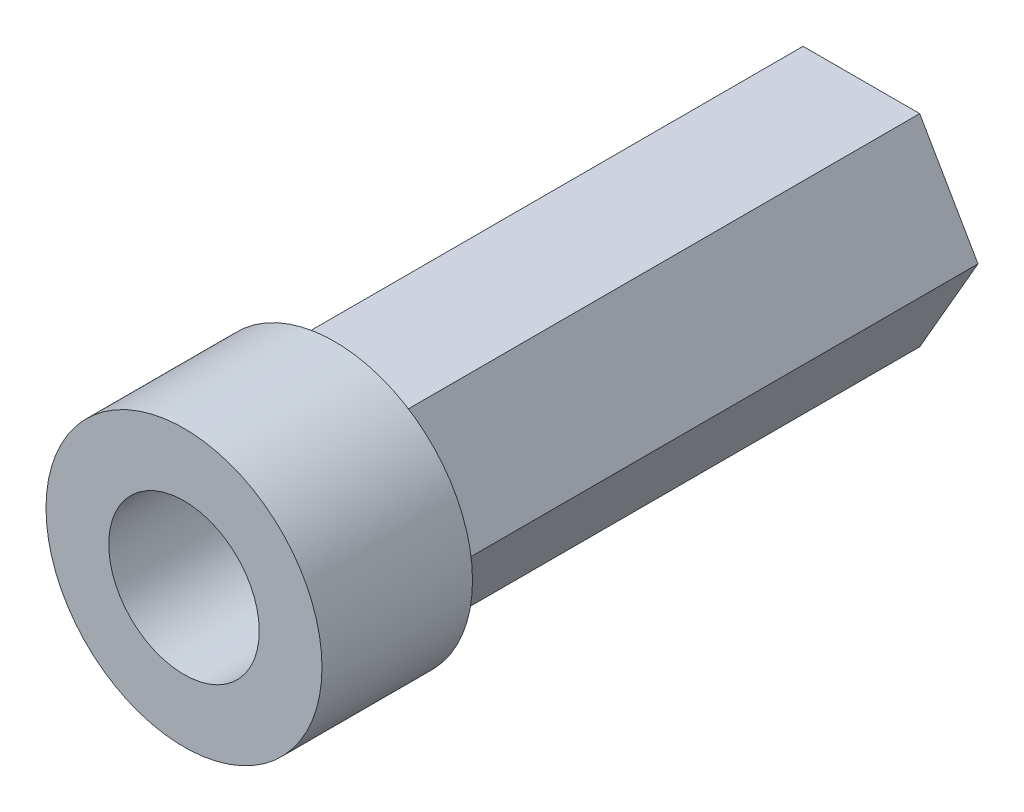
ISO-10303-21;
HEADER;
FILE_DESCRIPTION(('STEP AP214'),'2;1');
FILE_NAME('part.step','',(''),(''),'','','');
FILE_SCHEMA(('AUTOMOTIVE_DESIGN { 1 0 10303 214 1 1 1 1 }'));
ENDSEC;
DATA;
#1=APPLICATION_CONTEXT('core data for automotive mechanical design processes');
#2=APPLICATION_PROTOCOL_DEFINITION('international standard','automotive_design',2000,#1);
#3=PRODUCT_CONTEXT('',#1,'mechanical');
#4=PRODUCT('Part','Part','',(#3));
#5=PRODUCT_RELATED_PRODUCT_CATEGORY('part','',(#4));
#6=PRODUCT_DEFINITION_FORMATION('','',#4);
#7=PRODUCT_DEFINITION_CONTEXT('part definition',#1,'design');
#8=PRODUCT_DEFINITION('design','',#6,#7);
#9=PRODUCT_DEFINITION_SHAPE('','',#8);
#10=(LENGTH_UNIT() NAMED_UNIT(*) SI_UNIT(.MILLI.,.METRE.));
#11=(NAMED_UNIT(*) PLANE_ANGLE_UNIT() SI_UNIT($,.RADIAN.));
#12=(NAMED_UNIT(*) SI_UNIT($,.STERADIAN.) SOLID_ANGLE_UNIT());
#13=UNCERTAINTY_MEASURE_WITH_UNIT(LENGTH_MEASURE(1.E-05),#10,'distance_accuracy_value','');
#14=(GEOMETRIC_REPRESENTATION_CONTEXT(3) GLOBAL_UNCERTAINTY_ASSIGNED_CONTEXT((#13)) GLOBAL_UNIT_ASSIGNED_CONTEXT((#10,
#11,#12)) REPRESENTATION_CONTEXT('',''));
#15=CARTESIAN_POINT('',(0.,0.,0.));
#16=DIRECTION('',(0.,0.,1.));
#17=DIRECTION('',(1.,0.,0.));
#18=AXIS2_PLACEMENT_3D('',#15,#16,#17);
#19=CARTESIAN_POINT('',(0.,0.,6.));
#20=DIRECTION('',(0.,0.,-1.));
#21=DIRECTION('',(-1.,0.,0.));
#22=AXIS2_PLACEMENT_3D('',#19,#20,#21);
#23=CYLINDRICAL_SURFACE('',#22,3.);
#24=CARTESIAN_POINT('',(0.,0.,6.));
#25=DIRECTION('',(0.,0.,1.));
#26=DIRECTION('',(1.,0.,0.));
#27=AXIS2_PLACEMENT_3D('',#24,#25,#26);
#28=CIRCLE('',#27,3.);
#29=CARTESIAN_POINT('',(3.,0.,6.));
#30=VERTEX_POINT('',#29);
#31=EDGE_CURVE('E47',#30,#30,#28,.T.);
#32=ORIENTED_EDGE('',*,*,#31,.T.);
#33=EDGE_LOOP('',(#32));
#34=FACE_BOUND('',#33,.T.);
#35=CARTESIAN_POINT('',(0.,0.,-21.));
#36=DIRECTION('',(0.,0.,1.));
#37=DIRECTION('',(1.,0.,0.));
#38=AXIS2_PLACEMENT_3D('',#35,#36,#37);
#39=CIRCLE('',#38,3.);
#40=CARTESIAN_POINT('',(3.,0.,-21.));
#41=VERTEX_POINT('',#40);
#42=EDGE_CURVE('E144',#41,#41,#39,.T.);
#43=ORIENTED_EDGE('',*,*,#42,.F.);
#44=EDGE_LOOP('',(#43));
#45=FACE_BOUND('',#44,.T.);
#46=ADVANCED_FACE('F39',(#34,#45),#23,.F.);
#47=CARTESIAN_POINT('',(0.,0.,6.));
#48=DIRECTION('',(0.,0.,-1.));
#49=DIRECTION('',(-1.,0.,0.));
#50=AXIS2_PLACEMENT_3D('',#47,#48,#49);
#51=CYLINDRICAL_SURFACE('',#50,5.5);
#52=CARTESIAN_POINT('',(0.,0.,6.));
#53=DIRECTION('',(0.,0.,1.));
#54=DIRECTION('',(1.,0.,0.));
#55=AXIS2_PLACEMENT_3D('',#52,#53,#54);
#56=CIRCLE('',#55,5.5);
#57=CARTESIAN_POINT('',(5.5,0.,6.));
#58=VERTEX_POINT('',#57);
#59=EDGE_CURVE('E11',#58,#58,#56,.T.);
#60=ORIENTED_EDGE('',*,*,#59,.F.);
#61=EDGE_LOOP('',(#60));
#62=FACE_BOUND('',#61,.T.);
#63=CARTESIAN_POINT('',(0.,0.,0.));
#64=DIRECTION('',(0.,0.,1.));
#65=DIRECTION('',(1.,0.,0.));
#66=AXIS2_PLACEMENT_3D('',#63,#64,#65);
#67=CIRCLE('',#66,5.5);
#68=CARTESIAN_POINT('',(5.5,0.,0.));
#69=VERTEX_POINT('',#68);
#70=EDGE_CURVE('E42',#69,#69,#67,.T.);
#71=ORIENTED_EDGE('',*,*,#70,.T.);
#72=EDGE_LOOP('',(#71));
#73=FACE_BOUND('',#72,.T.);
#74=ADVANCED_FACE('F157',(#62,#73),#51,.T.);
#75=CARTESIAN_POINT('',(0.,0.,6.));
#76=DIRECTION('',(0.,0.,1.));
#77=DIRECTION('',(1.,0.,0.));
#78=AXIS2_PLACEMENT_3D('',#75,#76,#77);
#79=PLANE('',#78);
#80=ORIENTED_EDGE('',*,*,#31,.F.);
#81=EDGE_LOOP('',(#80));
#82=FACE_BOUND('',#81,.T.);
#83=ORIENTED_EDGE('',*,*,#59,.T.);
#84=EDGE_LOOP('',(#83));
#85=FACE_BOUND('',#84,.T.);
#86=ADVANCED_FACE('F162',(#82,#85),#79,.T.);
#87=CARTESIAN_POINT('',(0.,0.,0.));
#88=DIRECTION('',(0.,0.,1.));
#89=DIRECTION('',(1.,0.,0.));
#90=AXIS2_PLACEMENT_3D('',#87,#88,#89);
#91=PLANE('',#90);
#92=DIRECTION('',(0.5,0.866025403784439,0.));
#93=VECTOR('',#92,1.);
#94=CARTESIAN_POINT('',(3.48575225023236,-2.0125,0.));
#95=LINE('',#94,#93);
#96=CARTESIAN_POINT('',(2.32383483348824,-4.025,0.));
#97=VERTEX_POINT('',#96);
#98=CARTESIAN_POINT('',(4.64766966697649,0.,0.));
#99=VERTEX_POINT('',#98);
#100=EDGE_CURVE('E141',#97,#99,#95,.T.);
#101=ORIENTED_EDGE('',*,*,#100,.T.);
#102=DIRECTION('',(-0.5,0.866025403784439,0.));
#103=VECTOR('',#102,1.);
#104=CARTESIAN_POINT('',(3.48575225023237,2.0125,0.));
#105=LINE('',#104,#103);
#106=CARTESIAN_POINT('',(2.32383483348825,4.025,0.));
#107=VERTEX_POINT('',#106);
#108=EDGE_CURVE('E131',#99,#107,#105,.T.);
#109=ORIENTED_EDGE('',*,*,#108,.T.);
#110=DIRECTION('',(-1.,0.,0.));
#111=VECTOR('',#110,1.);
#112=CARTESIAN_POINT('',(0.,4.025,0.));
#113=LINE('',#112,#111);
#114=CARTESIAN_POINT('',(-2.32383483348824,4.025,0.));
#115=VERTEX_POINT('',#114);
#116=EDGE_CURVE('E134',#107,#115,#113,.T.);
#117=ORIENTED_EDGE('',*,*,#116,.T.);
#118=DIRECTION('',(-0.5,-0.866025403784439,0.));
#119=VECTOR('',#118,1.);
#120=CARTESIAN_POINT('',(-3.48575225023236,2.0125,0.));
#121=LINE('',#120,#119);
#122=CARTESIAN_POINT('',(-4.64766966697649,0.,0.));
#123=VERTEX_POINT('',#122);
#124=EDGE_CURVE('E54',#115,#123,#121,.T.);
#125=ORIENTED_EDGE('',*,*,#124,.T.);
#126=DIRECTION('',(0.5,-0.866025403784439,0.));
#127=VECTOR('',#126,1.);
#128=CARTESIAN_POINT('',(-3.48575225023237,-2.0125,0.));
#129=LINE('',#128,#127);
#130=CARTESIAN_POINT('',(-2.32383483348825,-4.025,0.));
#131=VERTEX_POINT('',#130);
#132=EDGE_CURVE('E138',#123,#131,#129,.T.);
#133=ORIENTED_EDGE('',*,*,#132,.T.);
#134=DIRECTION('',(1.,0.,0.));
#135=VECTOR('',#134,1.);
#136=CARTESIAN_POINT('',(0.,-4.025,0.));
#137=LINE('',#136,#135);
#138=EDGE_CURVE('E107',#131,#97,#137,.T.);
#139=ORIENTED_EDGE('',*,*,#138,.T.);
#140=EDGE_LOOP('',(#101,#109,#117,#125,#133,#139));
#141=FACE_BOUND('',#140,.T.);
#142=ORIENTED_EDGE('',*,*,#70,.F.);
#143=EDGE_LOOP('',(#142));
#144=FACE_BOUND('',#143,.T.);
#145=ADVANCED_FACE('F159',(#141,#144),#91,.F.);
#146=CARTESIAN_POINT('',(3.48575225023237,2.0125,-21.));
#147=DIRECTION('',(0.866025403784439,0.5,0.));
#148=DIRECTION('',(-0.5,0.866025403784439,0.));
#149=AXIS2_PLACEMENT_3D('',#146,#147,#148);
#150=PLANE('',#149);
#151=ORIENTED_EDGE('',*,*,#108,.F.);
#152=DIRECTION('',(0.,0.,1.));
#153=VECTOR('',#152,1.);
#154=CARTESIAN_POINT('',(4.64766966697649,0.,-21.));
#155=LINE('',#154,#153);
#156=CARTESIAN_POINT('',(4.64766966697649,0.,-21.));
#157=VERTEX_POINT('',#156);
#158=EDGE_CURVE('E63',#157,#99,#155,.T.);
#159=ORIENTED_EDGE('',*,*,#158,.F.);
#160=DIRECTION('',(-0.5,0.866025403784439,0.));
#161=VECTOR('',#160,1.);
#162=CARTESIAN_POINT('',(3.48575225023237,2.0125,-21.));
#163=LINE('',#162,#161);
#164=CARTESIAN_POINT('',(2.32383483348825,4.025,-21.));
#165=VERTEX_POINT('',#164);
#166=EDGE_CURVE('E182',#157,#165,#163,.T.);
#167=ORIENTED_EDGE('',*,*,#166,.T.);
#168=DIRECTION('',(0.,0.,1.));
#169=VECTOR('',#168,1.);
#170=CARTESIAN_POINT('',(2.32383483348825,4.025,-21.));
#171=LINE('',#170,#169);
#172=EDGE_CURVE('E91',#165,#107,#171,.T.);
#173=ORIENTED_EDGE('',*,*,#172,.T.);
#174=EDGE_LOOP('',(#151,#159,#167,#173));
#175=FACE_BOUND('',#174,.T.);
#176=ADVANCED_FACE('F161',(#175),#150,.T.);
#177=CARTESIAN_POINT('',(3.48575225023236,-2.0125,-21.));
#178=DIRECTION('',(0.866025403784439,-0.5,0.));
#179=DIRECTION('',(0.5,0.866025403784439,0.));
#180=AXIS2_PLACEMENT_3D('',#177,#178,#179);
#181=PLANE('',#180);
#182=ORIENTED_EDGE('',*,*,#100,.F.);
#183=DIRECTION('',(0.,0.,1.));
#184=VECTOR('',#183,1.);
#185=CARTESIAN_POINT('',(2.32383483348824,-4.025,-21.));
#186=LINE('',#185,#184);
#187=CARTESIAN_POINT('',(2.32383483348824,-4.025,-21.));
#188=VERTEX_POINT('',#187);
#189=EDGE_CURVE('E112',#188,#97,#186,.T.);
#190=ORIENTED_EDGE('',*,*,#189,.F.);
#191=DIRECTION('',(0.5,0.866025403784439,0.));
#192=VECTOR('',#191,1.);
#193=CARTESIAN_POINT('',(3.48575225023236,-2.0125,-21.));
#194=LINE('',#193,#192);
#195=EDGE_CURVE('E121',#188,#157,#194,.T.);
#196=ORIENTED_EDGE('',*,*,#195,.T.);
#197=ORIENTED_EDGE('',*,*,#158,.T.);
#198=EDGE_LOOP('',(#182,#190,#196,#197));
#199=FACE_BOUND('',#198,.T.);
#200=ADVANCED_FACE('F169',(#199),#181,.T.);
#201=CARTESIAN_POINT('',(0.,-4.025,-21.));
#202=DIRECTION('',(0.,-1.,0.));
#203=DIRECTION('',(0.,0.,-1.));
#204=AXIS2_PLACEMENT_3D('',#201,#202,#203);
#205=PLANE('',#204);
#206=ORIENTED_EDGE('',*,*,#138,.F.);
#207=DIRECTION('',(0.,0.,1.));
#208=VECTOR('',#207,1.);
#209=CARTESIAN_POINT('',(-2.32383483348825,-4.025,-21.));
#210=LINE('',#209,#208);
#211=CARTESIAN_POINT('',(-2.32383483348825,-4.025,-21.));
#212=VERTEX_POINT('',#211);
#213=EDGE_CURVE('E101',#212,#131,#210,.T.);
#214=ORIENTED_EDGE('',*,*,#213,.F.);
#215=DIRECTION('',(1.,0.,0.));
#216=VECTOR('',#215,1.);
#217=CARTESIAN_POINT('',(0.,-4.025,-21.));
#218=LINE('',#217,#216);
#219=EDGE_CURVE('E104',#212,#188,#218,.T.);
#220=ORIENTED_EDGE('',*,*,#219,.T.);
#221=ORIENTED_EDGE('',*,*,#189,.T.);
#222=EDGE_LOOP('',(#206,#214,#220,#221));
#223=FACE_BOUND('',#222,.T.);
#224=ADVANCED_FACE('F103',(#223),#205,.T.);
#225=CARTESIAN_POINT('',(-3.48575225023237,-2.0125,-21.));
#226=DIRECTION('',(-0.866025403784439,-0.5,0.));
#227=DIRECTION('',(0.5,-0.866025403784439,0.));
#228=AXIS2_PLACEMENT_3D('',#225,#226,#227);
#229=PLANE('',#228);
#230=ORIENTED_EDGE('',*,*,#132,.F.);
#231=DIRECTION('',(0.,0.,1.));
#232=VECTOR('',#231,1.);
#233=CARTESIAN_POINT('',(-4.64766966697649,0.,-21.));
#234=LINE('',#233,#232);
#235=CARTESIAN_POINT('',(-4.64766966697649,0.,-21.));
#236=VERTEX_POINT('',#235);
#237=EDGE_CURVE('E113',#236,#123,#234,.T.);
#238=ORIENTED_EDGE('',*,*,#237,.F.);
#239=DIRECTION('',(0.5,-0.866025403784439,0.));
#240=VECTOR('',#239,1.);
#241=CARTESIAN_POINT('',(-3.48575225023237,-2.0125,-21.));
#242=LINE('',#241,#240);
#243=EDGE_CURVE('E119',#236,#212,#242,.T.);
#244=ORIENTED_EDGE('',*,*,#243,.T.);
#245=ORIENTED_EDGE('',*,*,#213,.T.);
#246=EDGE_LOOP('',(#230,#238,#244,#245));
#247=FACE_BOUND('',#246,.T.);
#248=ADVANCED_FACE('F123',(#247),#229,.T.);
#249=CARTESIAN_POINT('',(-3.48575225023236,2.0125,-21.));
#250=DIRECTION('',(-0.866025403784438,0.5,0.));
#251=DIRECTION('',(-0.5,-0.866025403784439,0.));
#252=AXIS2_PLACEMENT_3D('',#249,#250,#251);
#253=PLANE('',#252);
#254=ORIENTED_EDGE('',*,*,#124,.F.);
#255=DIRECTION('',(0.,0.,1.));
#256=VECTOR('',#255,1.);
#257=CARTESIAN_POINT('',(-2.32383483348824,4.025,-21.));
#258=LINE('',#257,#256);
#259=CARTESIAN_POINT('',(-2.32383483348824,4.025,-21.));
#260=VERTEX_POINT('',#259);
#261=EDGE_CURVE('E148',#260,#115,#258,.T.);
#262=ORIENTED_EDGE('',*,*,#261,.F.);
#263=DIRECTION('',(-0.5,-0.866025403784439,0.));
#264=VECTOR('',#263,1.);
#265=CARTESIAN_POINT('',(-3.48575225023236,2.0125,-21.));
#266=LINE('',#265,#264);
#267=EDGE_CURVE('E124',#260,#236,#266,.T.);
#268=ORIENTED_EDGE('',*,*,#267,.T.);
#269=ORIENTED_EDGE('',*,*,#237,.T.);
#270=EDGE_LOOP('',(#254,#262,#268,#269));
#271=FACE_BOUND('',#270,.T.);
#272=ADVANCED_FACE('F196',(#271),#253,.T.);
#273=CARTESIAN_POINT('',(0.,4.025,-21.));
#274=DIRECTION('',(0.,1.,0.));
#275=DIRECTION('',(0.,0.,1.));
#276=AXIS2_PLACEMENT_3D('',#273,#274,#275);
#277=PLANE('',#276);
#278=ORIENTED_EDGE('',*,*,#116,.F.);
#279=ORIENTED_EDGE('',*,*,#172,.F.);
#280=DIRECTION('',(-1.,0.,0.));
#281=VECTOR('',#280,1.);
#282=CARTESIAN_POINT('',(0.,4.025,-21.));
#283=LINE('',#282,#281);
#284=EDGE_CURVE('E126',#165,#260,#283,.T.);
#285=ORIENTED_EDGE('',*,*,#284,.T.);
#286=ORIENTED_EDGE('',*,*,#261,.T.);
#287=EDGE_LOOP('',(#278,#279,#285,#286));
#288=FACE_BOUND('',#287,.T.);
#289=ADVANCED_FACE('F185',(#288),#277,.T.);
#290=CARTESIAN_POINT('',(0.,0.,-21.));
#291=DIRECTION('',(0.,0.,1.));
#292=DIRECTION('',(1.,0.,0.));
#293=AXIS2_PLACEMENT_3D('',#290,#291,#292);
#294=PLANE('',#293);
#295=ORIENTED_EDGE('',*,*,#42,.T.);
#296=EDGE_LOOP('',(#295));
#297=FACE_BOUND('',#296,.T.);
#298=ORIENTED_EDGE('',*,*,#166,.F.);
#299=ORIENTED_EDGE('',*,*,#195,.F.);
#300=ORIENTED_EDGE('',*,*,#219,.F.);
#301=ORIENTED_EDGE('',*,*,#243,.F.);
#302=ORIENTED_EDGE('',*,*,#267,.F.);
#303=ORIENTED_EDGE('',*,*,#284,.F.);
#304=EDGE_LOOP('',(#298,#299,#300,#301,#302,#303));
#305=FACE_BOUND('',#304,.T.);
#306=ADVANCED_FACE('F117',(#297,#305),#294,.F.);
#307=CLOSED_SHELL('',(#46,#74,#86,#145,#176,#200,#224,#248,#272,#289,#306));
#308=MANIFOLD_SOLID_BREP('B2',#307);
#309=ADVANCED_BREP_SHAPE_REPRESENTATION('',(#18,#308),#14);
#310=SHAPE_DEFINITION_REPRESENTATION(#9,#309);
ENDSEC;
END-ISO-10303-21;
